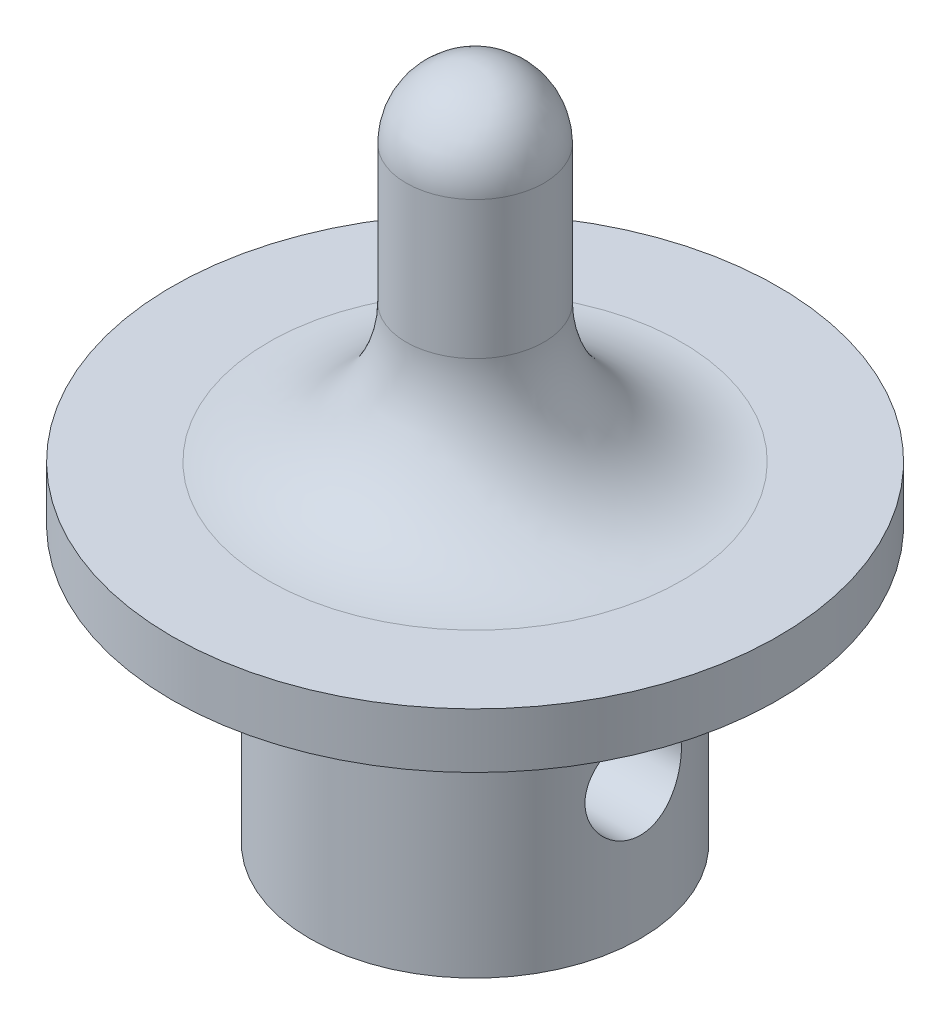
ISO-10303-21;
HEADER;
FILE_DESCRIPTION(('STEP AP214'),'2;1');
FILE_NAME('part.step','',(''),(''),'','','');
FILE_SCHEMA(('AUTOMOTIVE_DESIGN { 1 0 10303 214 1 1 1 1 }'));
ENDSEC;
DATA;
#1=APPLICATION_CONTEXT('core data for automotive mechanical design processes');
#2=APPLICATION_PROTOCOL_DEFINITION('international standard','automotive_design',2000,#1);
#3=PRODUCT_CONTEXT('',#1,'mechanical');
#4=PRODUCT('Part','Part','',(#3));
#5=PRODUCT_RELATED_PRODUCT_CATEGORY('part','',(#4));
#6=PRODUCT_DEFINITION_FORMATION('','',#4);
#7=PRODUCT_DEFINITION_CONTEXT('part definition',#1,'design');
#8=PRODUCT_DEFINITION('design','',#6,#7);
#9=PRODUCT_DEFINITION_SHAPE('','',#8);
#10=(LENGTH_UNIT() NAMED_UNIT(*) SI_UNIT(.MILLI.,.METRE.));
#11=(NAMED_UNIT(*) PLANE_ANGLE_UNIT() SI_UNIT($,.RADIAN.));
#12=(NAMED_UNIT(*) SI_UNIT($,.STERADIAN.) SOLID_ANGLE_UNIT());
#13=UNCERTAINTY_MEASURE_WITH_UNIT(LENGTH_MEASURE(1.E-05),#10,'distance_accuracy_value','');
#14=(GEOMETRIC_REPRESENTATION_CONTEXT(3) GLOBAL_UNCERTAINTY_ASSIGNED_CONTEXT((#13)) GLOBAL_UNIT_ASSIGNED_CONTEXT((#10,
#11,#12)) REPRESENTATION_CONTEXT('',''));
#15=CARTESIAN_POINT('',(0.,0.,0.));
#16=DIRECTION('',(0.,0.,1.));
#17=DIRECTION('',(1.,0.,0.));
#18=AXIS2_PLACEMENT_3D('',#15,#16,#17);
#19=CARTESIAN_POINT('',(0.,10.,0.));
#20=DIRECTION('',(0.,-1.,0.));
#21=DIRECTION('',(0.,0.,-1.));
#22=AXIS2_PLACEMENT_3D('',#19,#20,#21);
#23=CYLINDRICAL_SURFACE('',#22,6.);
#24=CARTESIAN_POINT('',(-5.7391201416245,5.,-1.75));
#25=CARTESIAN_POINT('',(-5.73912135233217,5.09602715995552,-1.74999848143229));
#26=CARTESIAN_POINT('',(-5.74155660684102,5.19206949444774,-1.74206920201931));
#27=CARTESIAN_POINT('',(-5.75099819259011,5.38135515547064,-1.71063758772276));
#28=CARTESIAN_POINT('',(-5.75800624523015,5.47459741409895,-1.687129388205));
#29=CARTESIAN_POINT('',(-5.77573366437414,5.6555159827401,-1.62539891018832));
#30=CARTESIAN_POINT('',(-5.78644710700006,5.7432009141847,-1.58720010699206));
#31=CARTESIAN_POINT('',(-5.8103702792937,5.91093737895567,-1.49724903480251));
#32=CARTESIAN_POINT('',(-5.82358033749983,5.99098790555552,-1.44549498168001));
#33=CARTESIAN_POINT('',(-5.8514513800029,6.14357764056696,-1.32824554329378));
#34=CARTESIAN_POINT('',(-5.8661419700001,6.21585470861163,-1.26241596701889));
#35=CARTESIAN_POINT('',(-5.89506524619861,6.34851562030884,-1.11960099692238));
#36=CARTESIAN_POINT('',(-5.90929787649124,6.40889801640936,-1.04261424727684));
#37=CARTESIAN_POINT('',(-5.93603636207228,6.51718204764524,-0.877817715970357));
#38=CARTESIAN_POINT('',(-5.94850325436041,6.56481813477547,-0.789826574692591));
#39=CARTESIAN_POINT('',(-5.96996273194609,6.64451691487935,-0.60665777583481));
#40=CARTESIAN_POINT('',(-5.97895602343648,6.67658277366555,-0.511481583704489));
#41=CARTESIAN_POINT('',(-5.99224555879575,6.72336834014858,-0.319385326415657));
#42=CARTESIAN_POINT('',(-5.9966626309077,6.73853510932049,-0.222582653190642));
#43=CARTESIAN_POINT('',(-6.0007267618746,6.75250373902323,-0.0277126943123474));
#44=CARTESIAN_POINT('',(-6.00037476953799,6.75130885471505,0.0703543359177016));
#45=CARTESIAN_POINT('',(-5.99502665675503,6.7328920248792,0.261839339010207));
#46=CARTESIAN_POINT('',(-5.99017073825665,6.71615390354781,0.355308373260201));
#47=CARTESIAN_POINT('',(-5.97652948220135,6.66791379153903,0.538048126317028));
#48=CARTESIAN_POINT('',(-5.96774390133058,6.63641088666124,0.627318584781337));
#49=CARTESIAN_POINT('',(-5.94703299959619,6.55919682530651,0.800299191226942));
#50=CARTESIAN_POINT('',(-5.93507351157704,6.51333001035971,0.883935598008257));
#51=CARTESIAN_POINT('',(-5.9092886595426,6.4088122238901,1.04248200075495));
#52=CARTESIAN_POINT('',(-5.89546287280477,6.35015835420256,1.11739001252847));
#53=CARTESIAN_POINT('',(-5.8668341067276,6.21920633427248,1.25924141940852));
#54=CARTESIAN_POINT('',(-5.85201387983932,6.14648814247302,1.32579407024834));
#55=CARTESIAN_POINT('',(-5.82351168097608,5.99077579033852,1.44586660191142));
#56=CARTESIAN_POINT('',(-5.8098298096845,5.90778072266337,1.49938533073701));
#57=CARTESIAN_POINT('',(-5.78507419356831,5.73288961401348,1.59224878530753));
#58=CARTESIAN_POINT('',(-5.77402396450966,5.64092296865607,1.63146726373796));
#59=CARTESIAN_POINT('',(-5.75606450322795,5.45129498185252,1.69374851164605));
#60=CARTESIAN_POINT('',(-5.74915400670723,5.35363538907328,1.71681621402541));
#61=CARTESIAN_POINT('',(-5.74053185916609,5.15909608282925,1.7454256721976));
#62=CARTESIAN_POINT('',(-5.73864494944326,5.06231098788417,1.75155853244336));
#63=CARTESIAN_POINT('',(-5.73980029830615,4.86909377579415,1.74776921645584));
#64=CARTESIAN_POINT('',(-5.74284191154791,4.77266161409297,1.73784914220432));
#65=CARTESIAN_POINT('',(-5.75334026618617,4.58530316808429,1.70276068513146));
#66=CARTESIAN_POINT('',(-5.76068862380037,4.49430016112713,1.67796628113717));
#67=CARTESIAN_POINT('',(-5.77886185683533,4.31774980326421,1.61426316316258));
#68=CARTESIAN_POINT('',(-5.7896872485818,4.23220326488505,1.57535235284098));
#69=CARTESIAN_POINT('',(-5.81393978491672,4.06657214599055,1.48337952129907));
#70=CARTESIAN_POINT('',(-5.82742647058964,3.98668360317094,1.42998054711139));
#71=CARTESIAN_POINT('',(-5.85535101590732,3.83678479747277,1.31095181227824));
#72=CARTESIAN_POINT('',(-5.86978909009026,3.76677677391141,1.24531928682211));
#73=CARTESIAN_POINT('',(-5.89860806740746,3.63607534857196,1.10091901276198));
#74=CARTESIAN_POINT('',(-5.91296886248222,3.57579929648958,1.02176859620353));
#75=CARTESIAN_POINT('',(-5.93949812101069,3.46937861199076,0.854138226573397));
#76=CARTESIAN_POINT('',(-5.95166669713258,3.42323325324783,0.765658753335441));
#77=CARTESIAN_POINT('',(-5.97236405546361,3.34682721514996,0.582484879123573));
#78=CARTESIAN_POINT('',(-5.98092021102961,3.31644665900443,0.487843729255372));
#79=CARTESIAN_POINT('',(-5.99354961087298,3.27211266137465,0.294506890790337));
#80=CARTESIAN_POINT('',(-5.99762406124125,3.25815480023807,0.195812300452465));
#81=CARTESIAN_POINT('',(-6.00076178273783,3.24738342425057,0.00103743961966253));
#82=CARTESIAN_POINT('',(-6.00000245868248,3.24996299282584,-0.0950068407311699));
#83=CARTESIAN_POINT('',(-5.99397167828825,3.27075323057029,-0.285235716014249));
#84=CARTESIAN_POINT('',(-5.98870045407916,3.28896309558674,-0.379420406364288));
#85=CARTESIAN_POINT('',(-5.97428492757917,3.34012910237963,-0.562376479895316));
#86=CARTESIAN_POINT('',(-5.96517853614574,3.37294107673055,-0.651191371275258));
#87=CARTESIAN_POINT('',(-5.94403648997228,3.45225144324137,-0.822103394195299));
#88=CARTESIAN_POINT('',(-5.93200036970177,3.49875201074878,-0.904199455348201));
#89=CARTESIAN_POINT('',(-5.90580993303637,3.60577654816586,-1.06207963183778));
#90=CARTESIAN_POINT('',(-5.89160195176128,3.66668704973978,-1.13759275881333));
#91=CARTESIAN_POINT('',(-5.86285183048808,3.80009686891046,-1.27752965774599));
#92=CARTESIAN_POINT('',(-5.84830959756853,3.87259944328175,-1.34195030269254));
#93=CARTESIAN_POINT('',(-5.82006568044673,4.02954795589333,-1.45966022673122));
#94=CARTESIAN_POINT('',(-5.80639844866527,4.11426914830967,-1.51259163845185));
#95=CARTESIAN_POINT('',(-5.78198514023874,4.29179415346375,-1.60339388987167));
#96=CARTESIAN_POINT('',(-5.77123752324486,4.38459366992905,-1.64127267603193));
#97=CARTESIAN_POINT('',(-5.75505738666475,4.56392715012795,-1.69707126506049));
#98=CARTESIAN_POINT('',(-5.74913519026071,4.64983693794846,-1.71686706269423));
#99=CARTESIAN_POINT('',(-5.74116635043196,4.82382714791872,-1.74333098170632));
#100=CARTESIAN_POINT('',(-5.73911903095286,4.91190718870481,-1.7500013930944));
#101=CARTESIAN_POINT('',(-5.7391201416245,5.,-1.75));
#102=B_SPLINE_CURVE_WITH_KNOTS('',3,(#24,#25,#26,#27,#28,#29,#30,#31,#32,#33,#34,#35,#36,#37,
#38,#39,#40,#41,#42,#43,#44,#45,#46,#47,#48,#49,#50,#51,#52,#53,#54,#55,#56,#57,#58,#59,#60,#61,
#62,#63,#64,#65,#66,#67,#68,#69,#70,#71,#72,#73,#74,#75,#76,#77,#78,#79,#80,#81,#82,#83,#84,#85,
#86,#87,#88,#89,#90,#91,#92,#93,#94,#95,#96,#97,#98,#99,#100,#101),.UNSPECIFIED.,.T.,.F.,(4,2,2,
2,2,2,2,2,2,2,2,2,2,2,2,2,2,2,2,2,2,2,2,2,2,2,2,2,2,2,2,2,2,2,2,2,2,2,4),(0.,0.287756797222522,
0.575621981143362,0.863029060661796,1.15047398745513,1.44570366788229,1.74096925486194,
2.04197684943756,2.3429232160698,2.63570371118683,2.92842595829134,3.21233131865284,
3.49625426008391,3.78336718563481,4.07054525263202,4.36821044004191,4.66590192692268,
4.96616130350708,5.26632893237124,5.55587830513257,5.84538976717712,6.12791051105674,
6.41047322755234,6.70027379224019,6.99013993210846,7.29026491272892,7.59037446414679,
7.88816722411909,8.1858798241832,8.47273065365,8.75956672600379,9.04363159851127,
9.32774163809379,9.62056977394217,9.91348032442503,10.2145064741217,10.5153734967276,
10.7794001445159,11.0433807230145),.UNSPECIFIED.);
#103=CARTESIAN_POINT('',(-5.7391201416245,5.,-1.75));
#104=VERTEX_POINT('',#103);
#105=EDGE_CURVE('E35',#104,#104,#102,.T.);
#106=ORIENTED_EDGE('',*,*,#105,.T.);
#107=EDGE_LOOP('',(#106));
#108=FACE_BOUND('',#107,.T.);
#109=CARTESIAN_POINT('',(5.7391201416245,5.,-1.75));
#110=CARTESIAN_POINT('',(5.73912135233217,4.90397284004448,-1.74999848143229));
#111=CARTESIAN_POINT('',(5.74155660684102,4.80793050555226,-1.74206920201931));
#112=CARTESIAN_POINT('',(5.75099819259011,4.61864484452936,-1.71063758772276));
#113=CARTESIAN_POINT('',(5.75800624523015,4.52540258590105,-1.687129388205));
#114=CARTESIAN_POINT('',(5.77573366437414,4.3444840172599,-1.62539891018832));
#115=CARTESIAN_POINT('',(5.78644710700006,4.2567990858153,-1.58720010699206));
#116=CARTESIAN_POINT('',(5.8103702792937,4.08906262104433,-1.49724903480251));
#117=CARTESIAN_POINT('',(5.82358033749983,4.00901209444448,-1.44549498168001));
#118=CARTESIAN_POINT('',(5.8514513800029,3.85642235943304,-1.32824554329379));
#119=CARTESIAN_POINT('',(5.8661419700001,3.78414529138837,-1.26241596701889));
#120=CARTESIAN_POINT('',(5.89506524619861,3.65148437969116,-1.11960099692238));
#121=CARTESIAN_POINT('',(5.90929787649124,3.59110198359064,-1.04261424727684));
#122=CARTESIAN_POINT('',(5.93603636207228,3.48281795235476,-0.877817715970357));
#123=CARTESIAN_POINT('',(5.94850325436041,3.43518186522453,-0.789826574692591));
#124=CARTESIAN_POINT('',(5.96996273194609,3.35548308512065,-0.60665777583481));
#125=CARTESIAN_POINT('',(5.97895602343648,3.32341722633445,-0.511481583704489));
#126=CARTESIAN_POINT('',(5.99224555879575,3.27663165985142,-0.319385326415657));
#127=CARTESIAN_POINT('',(5.9966626309077,3.26146489067951,-0.222582653190642));
#128=CARTESIAN_POINT('',(6.0007267618746,3.24749626097677,-0.0277126943123477));
#129=CARTESIAN_POINT('',(6.00037476953799,3.24869114528495,0.0703543359177015));
#130=CARTESIAN_POINT('',(5.99502665675503,3.2671079751208,0.261839339010207));
#131=CARTESIAN_POINT('',(5.99017073825665,3.28384609645219,0.355308373260201));
#132=CARTESIAN_POINT('',(5.97652948220135,3.33208620846097,0.538048126317028));
#133=CARTESIAN_POINT('',(5.96774390133058,3.36358911333875,0.627318584781338));
#134=CARTESIAN_POINT('',(5.94703299959619,3.44080317469349,0.800299191226942));
#135=CARTESIAN_POINT('',(5.93507351157704,3.48666998964029,0.883935598008257));
#136=CARTESIAN_POINT('',(5.9092886595426,3.5911877761099,1.04248200075495));
#137=CARTESIAN_POINT('',(5.89546287280477,3.64984164579744,1.11739001252847));
#138=CARTESIAN_POINT('',(5.8668341067276,3.78079366572752,1.25924141940852));
#139=CARTESIAN_POINT('',(5.85201387983932,3.85351185752698,1.32579407024834));
#140=CARTESIAN_POINT('',(5.82351168097608,4.00922420966148,1.44586660191142));
#141=CARTESIAN_POINT('',(5.8098298096845,4.09221927733663,1.49938533073701));
#142=CARTESIAN_POINT('',(5.78507419356831,4.26711038598652,1.59224878530753));
#143=CARTESIAN_POINT('',(5.77402396450966,4.35907703134393,1.63146726373796));
#144=CARTESIAN_POINT('',(5.75606450322795,4.54870501814748,1.69374851164605));
#145=CARTESIAN_POINT('',(5.74915400670723,4.64636461092672,1.71681621402541));
#146=CARTESIAN_POINT('',(5.74053185916609,4.84090391717075,1.7454256721976));
#147=CARTESIAN_POINT('',(5.73864494944326,4.93768901211583,1.75155853244336));
#148=CARTESIAN_POINT('',(5.73980029830615,5.13090622420585,1.74776921645584));
#149=CARTESIAN_POINT('',(5.74284191154791,5.22733838590703,1.73784914220432));
#150=CARTESIAN_POINT('',(5.75334026618617,5.41469683191571,1.70276068513146));
#151=CARTESIAN_POINT('',(5.76068862380037,5.50569983887287,1.67796628113717));
#152=CARTESIAN_POINT('',(5.77886185683533,5.68225019673579,1.61426316316258));
#153=CARTESIAN_POINT('',(5.7896872485818,5.76779673511495,1.57535235284098));
#154=CARTESIAN_POINT('',(5.81393978491672,5.93342785400945,1.48337952129907));
#155=CARTESIAN_POINT('',(5.82742647058964,6.01331639682906,1.42998054711139));
#156=CARTESIAN_POINT('',(5.85535101590732,6.16321520252723,1.31095181227824));
#157=CARTESIAN_POINT('',(5.86978909009026,6.23322322608859,1.24531928682211));
#158=CARTESIAN_POINT('',(5.89860806740746,6.36392465142804,1.10091901276198));
#159=CARTESIAN_POINT('',(5.91296886248222,6.42420070351042,1.02176859620353));
#160=CARTESIAN_POINT('',(5.93949812101069,6.53062138800924,0.854138226573396));
#161=CARTESIAN_POINT('',(5.95166669713258,6.57676674675217,0.76565875333544));
#162=CARTESIAN_POINT('',(5.97236405546361,6.65317278485004,0.582484879123573));
#163=CARTESIAN_POINT('',(5.98092021102961,6.68355334099557,0.487843729255372));
#164=CARTESIAN_POINT('',(5.99354961087298,6.72788733862535,0.294506890790336));
#165=CARTESIAN_POINT('',(5.99762406124125,6.74184519976193,0.195812300452465));
#166=CARTESIAN_POINT('',(6.00076178273783,6.75261657574943,0.00103743961966302));
#167=CARTESIAN_POINT('',(6.00000245868248,6.75003700717416,-0.0950068407311688));
#168=CARTESIAN_POINT('',(5.99397167828825,6.72924676942971,-0.285235716014248));
#169=CARTESIAN_POINT('',(5.98870045407916,6.71103690441326,-0.379420406364288));
#170=CARTESIAN_POINT('',(5.97428492757917,6.65987089762037,-0.562376479895317));
#171=CARTESIAN_POINT('',(5.96517853614574,6.62705892326945,-0.651191371275259));
#172=CARTESIAN_POINT('',(5.94403648997228,6.54774855675863,-0.822103394195301));
#173=CARTESIAN_POINT('',(5.93200036970177,6.50124798925122,-0.904199455348201));
#174=CARTESIAN_POINT('',(5.90580993303637,6.39422345183415,-1.06207963183778));
#175=CARTESIAN_POINT('',(5.89160195176128,6.33331295026022,-1.13759275881333));
#176=CARTESIAN_POINT('',(5.86285183048808,6.19990313108954,-1.27752965774599));
#177=CARTESIAN_POINT('',(5.84830959756853,6.12740055671825,-1.34195030269254));
#178=CARTESIAN_POINT('',(5.82006568044673,5.97045204410667,-1.45966022673122));
#179=CARTESIAN_POINT('',(5.80639844866527,5.88573085169033,-1.51259163845185));
#180=CARTESIAN_POINT('',(5.78198514023874,5.70820584653625,-1.60339388987167));
#181=CARTESIAN_POINT('',(5.77123752324486,5.61540633007095,-1.64127267603193));
#182=CARTESIAN_POINT('',(5.75505738666475,5.43607284987205,-1.69707126506049));
#183=CARTESIAN_POINT('',(5.74913519026071,5.35016306205154,-1.71686706269423));
#184=CARTESIAN_POINT('',(5.74116635043196,5.17617285208128,-1.74333098170632));
#185=CARTESIAN_POINT('',(5.73911903095286,5.08809281129519,-1.7500013930944));
#186=CARTESIAN_POINT('',(5.7391201416245,5.,-1.75));
#187=B_SPLINE_CURVE_WITH_KNOTS('',3,(#109,#110,#111,#112,#113,#114,#115,#116,#117,#118,#119,
#120,#121,#122,#123,#124,#125,#126,#127,#128,#129,#130,#131,#132,#133,#134,#135,#136,#137,#138,
#139,#140,#141,#142,#143,#144,#145,#146,#147,#148,#149,#150,#151,#152,#153,#154,#155,#156,#157,
#158,#159,#160,#161,#162,#163,#164,#165,#166,#167,#168,#169,#170,#171,#172,#173,#174,#175,#176,
#177,#178,#179,#180,#181,#182,#183,#184,#185,#186),.UNSPECIFIED.,.T.,.F.,(4,2,2,2,2,2,2,2,2,2,2,
2,2,2,2,2,2,2,2,2,2,2,2,2,2,2,2,2,2,2,2,2,2,2,2,2,2,2,4),(0.,0.287756797222522,
0.575621981143362,0.863029060661796,1.15047398745512,1.44570366788229,1.74096925486194,
2.04197684943756,2.3429232160698,2.63570371118683,2.92842595829134,3.21233131865284,
3.49625426008391,3.78336718563481,4.07054525263202,4.36821044004191,4.66590192692268,
4.96616130350708,5.26632893237124,5.55587830513257,5.84538976717713,6.12791051105674,
6.41047322755234,6.70027379224019,6.99013993210846,7.29026491272893,7.5903744641468,
7.88816722411909,8.1858798241832,8.47273065365,8.75956672600379,9.04363159851127,
9.32774163809379,9.62056977394216,9.91348032442503,10.2145064741217,10.5153734967276,
10.7794001445159,11.0433807230145),.UNSPECIFIED.);
#188=CARTESIAN_POINT('',(5.7391201416245,5.,-1.75));
#189=VERTEX_POINT('',#188);
#190=EDGE_CURVE('E51',#189,#189,#187,.T.);
#191=ORIENTED_EDGE('',*,*,#190,.T.);
#192=EDGE_LOOP('',(#191));
#193=FACE_BOUND('',#192,.T.);
#194=CARTESIAN_POINT('',(0.,10.,0.));
#195=DIRECTION('',(0.,1.,0.));
#196=DIRECTION('',(0.,0.,1.));
#197=AXIS2_PLACEMENT_3D('',#194,#195,#196);
#198=CIRCLE('',#197,6.);
#199=CARTESIAN_POINT('',(0.,10.,6.));
#200=VERTEX_POINT('',#199);
#201=EDGE_CURVE('E48',#200,#200,#198,.T.);
#202=ORIENTED_EDGE('',*,*,#201,.F.);
#203=EDGE_LOOP('',(#202));
#204=FACE_BOUND('',#203,.T.);
#205=CARTESIAN_POINT('',(0.,0.,0.));
#206=DIRECTION('',(0.,1.,0.));
#207=DIRECTION('',(0.,0.,1.));
#208=AXIS2_PLACEMENT_3D('',#205,#206,#207);
#209=CIRCLE('',#208,6.);
#210=CARTESIAN_POINT('',(0.,0.,6.));
#211=VERTEX_POINT('',#210);
#212=EDGE_CURVE('E92',#211,#211,#209,.T.);
#213=ORIENTED_EDGE('',*,*,#212,.T.);
#214=EDGE_LOOP('',(#213));
#215=FACE_BOUND('',#214,.T.);
#216=ADVANCED_FACE('F31',(#108,#193,#204,#215),#23,.T.);
#217=CARTESIAN_POINT('',(0.,0.,0.));
#218=DIRECTION('',(0.,1.,0.));
#219=DIRECTION('',(0.,0.,1.));
#220=AXIS2_PLACEMENT_3D('',#217,#218,#219);
#221=PLANE('',#220);
#222=ORIENTED_EDGE('',*,*,#212,.F.);
#223=EDGE_LOOP('',(#222));
#224=FACE_BOUND('',#223,.T.);
#225=ADVANCED_FACE('F81',(#224),#221,.F.);
#226=CARTESIAN_POINT('',(0.,12.,0.));
#227=DIRECTION('',(0.,-1.,0.));
#228=DIRECTION('',(0.,0.,-1.));
#229=AXIS2_PLACEMENT_3D('',#226,#227,#228);
#230=CYLINDRICAL_SURFACE('',#229,11.);
#231=CARTESIAN_POINT('',(0.,12.,0.));
#232=DIRECTION('',(0.,1.,0.));
#233=DIRECTION('',(0.,0.,1.));
#234=AXIS2_PLACEMENT_3D('',#231,#232,#233);
#235=CIRCLE('',#234,11.);
#236=CARTESIAN_POINT('',(0.,12.,11.));
#237=VERTEX_POINT('',#236);
#238=EDGE_CURVE('E94',#237,#237,#235,.T.);
#239=ORIENTED_EDGE('',*,*,#238,.F.);
#240=EDGE_LOOP('',(#239));
#241=FACE_BOUND('',#240,.T.);
#242=CARTESIAN_POINT('',(0.,10.,0.));
#243=DIRECTION('',(0.,1.,0.));
#244=DIRECTION('',(0.,0.,1.));
#245=AXIS2_PLACEMENT_3D('',#242,#243,#244);
#246=CIRCLE('',#245,11.);
#247=CARTESIAN_POINT('',(0.,10.,11.));
#248=VERTEX_POINT('',#247);
#249=EDGE_CURVE('E98',#248,#248,#246,.T.);
#250=ORIENTED_EDGE('',*,*,#249,.T.);
#251=EDGE_LOOP('',(#250));
#252=FACE_BOUND('',#251,.T.);
#253=ADVANCED_FACE('F76',(#241,#252),#230,.T.);
#254=CARTESIAN_POINT('',(0.,12.,0.));
#255=DIRECTION('',(0.,1.,0.));
#256=DIRECTION('',(0.,0.,1.));
#257=AXIS2_PLACEMENT_3D('',#254,#255,#256);
#258=PLANE('',#257);
#259=CARTESIAN_POINT('',(0.,12.,0.));
#260=DIRECTION('',(0.,1.,0.));
#261=DIRECTION('',(0.,0.,1.));
#262=AXIS2_PLACEMENT_3D('',#259,#260,#261);
#263=CIRCLE('',#262,7.5);
#264=CARTESIAN_POINT('',(0.,12.,7.5));
#265=VERTEX_POINT('',#264);
#266=EDGE_CURVE('E10',#265,#265,#263,.F.);
#267=ORIENTED_EDGE('',*,*,#266,.T.);
#268=EDGE_LOOP('',(#267));
#269=FACE_BOUND('',#268,.T.);
#270=ORIENTED_EDGE('',*,*,#238,.T.);
#271=EDGE_LOOP('',(#270));
#272=FACE_BOUND('',#271,.T.);
#273=ADVANCED_FACE('F73',(#269,#272),#258,.T.);
#274=CARTESIAN_POINT('',(0.,10.,0.));
#275=DIRECTION('',(0.,1.,0.));
#276=DIRECTION('',(0.,0.,1.));
#277=AXIS2_PLACEMENT_3D('',#274,#275,#276);
#278=PLANE('',#277);
#279=ORIENTED_EDGE('',*,*,#201,.T.);
#280=EDGE_LOOP('',(#279));
#281=FACE_BOUND('',#280,.T.);
#282=ORIENTED_EDGE('',*,*,#249,.F.);
#283=EDGE_LOOP('',(#282));
#284=FACE_BOUND('',#283,.T.);
#285=ADVANCED_FACE('F71',(#281,#284),#278,.F.);
#286=CARTESIAN_POINT('',(0.,24.5,0.));
#287=DIRECTION('',(0.,1.,0.));
#288=DIRECTION('',(0.,0.,1.));
#289=AXIS2_PLACEMENT_3D('',#286,#287,#288);
#290=CYLINDRICAL_SURFACE('',#289,2.5);
#291=CARTESIAN_POINT('',(0.,17.,0.));
#292=DIRECTION('',(0.,1.,0.));
#293=DIRECTION('',(0.,0.,1.));
#294=AXIS2_PLACEMENT_3D('',#291,#292,#293);
#295=CIRCLE('',#294,2.5);
#296=CARTESIAN_POINT('',(0.,17.,2.5));
#297=VERTEX_POINT('',#296);
#298=EDGE_CURVE('E43',#297,#297,#295,.T.);
#299=ORIENTED_EDGE('',*,*,#298,.T.);
#300=EDGE_LOOP('',(#299));
#301=FACE_BOUND('',#300,.T.);
#302=CARTESIAN_POINT('',(0.,22.,0.));
#303=DIRECTION('',(0.,1.,0.));
#304=DIRECTION('',(0.,0.,1.));
#305=AXIS2_PLACEMENT_3D('',#302,#303,#304);
#306=CIRCLE('',#305,2.5);
#307=CARTESIAN_POINT('',(0.,22.,2.5));
#308=VERTEX_POINT('',#307);
#309=EDGE_CURVE('E102',#308,#308,#306,.T.);
#310=ORIENTED_EDGE('',*,*,#309,.F.);
#311=EDGE_LOOP('',(#310));
#312=FACE_BOUND('',#311,.T.);
#313=ADVANCED_FACE('F67',(#301,#312),#290,.T.);
#314=CARTESIAN_POINT('',(0.,22.,0.));
#315=DIRECTION('',(0.,1.,0.));
#316=DIRECTION('',(0.,0.,-1.));
#317=AXIS2_PLACEMENT_3D('',#314,#315,#316);
#318=SPHERICAL_SURFACE('',#317,2.5);
#319=ORIENTED_EDGE('',*,*,#309,.T.);
#320=EDGE_LOOP('',(#319));
#321=FACE_BOUND('',#320,.T.);
#322=ADVANCED_FACE('F63',(#321),#318,.T.);
#323=CARTESIAN_POINT('',(0.,17.,0.));
#324=DIRECTION('',(0.,1.,0.));
#325=DIRECTION('',(0.,0.,1.));
#326=AXIS2_PLACEMENT_3D('',#323,#324,#325);
#327=TOROIDAL_SURFACE('',#326,7.5,5.);
#328=ORIENTED_EDGE('',*,*,#266,.F.);
#329=EDGE_LOOP('',(#328));
#330=FACE_BOUND('',#329,.T.);
#331=ORIENTED_EDGE('',*,*,#298,.F.);
#332=EDGE_LOOP('',(#331));
#333=FACE_BOUND('',#332,.T.);
#334=ADVANCED_FACE('F33',(#330,#333),#327,.F.);
#335=CARTESIAN_POINT('',(-11.,5.,0.));
#336=DIRECTION('',(1.,0.,0.));
#337=DIRECTION('',(0.,0.,-1.));
#338=AXIS2_PLACEMENT_3D('',#335,#336,#337);
#339=CYLINDRICAL_SURFACE('',#338,1.75);
#340=ORIENTED_EDGE('',*,*,#190,.F.);
#341=EDGE_LOOP('',(#340));
#342=FACE_BOUND('',#341,.T.);
#343=ORIENTED_EDGE('',*,*,#105,.F.);
#344=EDGE_LOOP('',(#343));
#345=FACE_BOUND('',#344,.T.);
#346=ADVANCED_FACE('F58',(#342,#345),#339,.F.);
#347=CLOSED_SHELL('',(#216,#225,#253,#273,#285,#313,#322,#334,#346));
#348=MANIFOLD_SOLID_BREP('B2',#347);
#349=ADVANCED_BREP_SHAPE_REPRESENTATION('',(#18,#348),#14);
#350=SHAPE_DEFINITION_REPRESENTATION(#9,#349);
ENDSEC;
END-ISO-10303-21;
